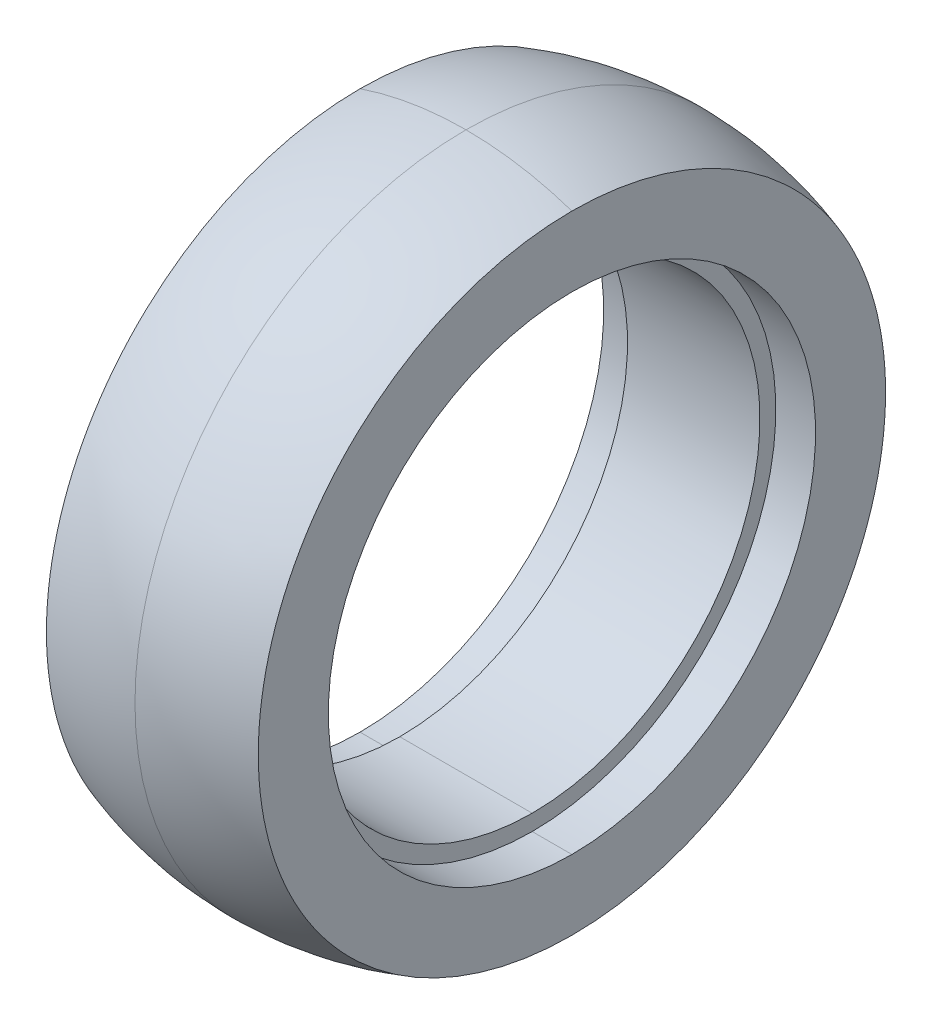
ISO-10303-21;
HEADER;
FILE_DESCRIPTION(('STEP AP214'),'2;1');
FILE_NAME('part.step','',(''),(''),'','','');
FILE_SCHEMA(('AUTOMOTIVE_DESIGN { 1 0 10303 214 1 1 1 1 }'));
ENDSEC;
DATA;
#1=APPLICATION_CONTEXT('core data for automotive mechanical design processes');
#2=APPLICATION_PROTOCOL_DEFINITION('international standard','automotive_design',2000,#1);
#3=PRODUCT_CONTEXT('',#1,'mechanical');
#4=PRODUCT('Part','Part','',(#3));
#5=PRODUCT_RELATED_PRODUCT_CATEGORY('part','',(#4));
#6=PRODUCT_DEFINITION_FORMATION('','',#4);
#7=PRODUCT_DEFINITION_CONTEXT('part definition',#1,'design');
#8=PRODUCT_DEFINITION('design','',#6,#7);
#9=PRODUCT_DEFINITION_SHAPE('','',#8);
#10=(LENGTH_UNIT() NAMED_UNIT(*) SI_UNIT(.MILLI.,.METRE.));
#11=(NAMED_UNIT(*) PLANE_ANGLE_UNIT() SI_UNIT($,.RADIAN.));
#12=(NAMED_UNIT(*) SI_UNIT($,.STERADIAN.) SOLID_ANGLE_UNIT());
#13=UNCERTAINTY_MEASURE_WITH_UNIT(LENGTH_MEASURE(1.E-05),#10,'distance_accuracy_value','');
#14=(GEOMETRIC_REPRESENTATION_CONTEXT(3) GLOBAL_UNCERTAINTY_ASSIGNED_CONTEXT((#13)) GLOBAL_UNIT_ASSIGNED_CONTEXT((#10,
#11,#12)) REPRESENTATION_CONTEXT('',''));
#15=CARTESIAN_POINT('',(0.,0.,0.));
#16=DIRECTION('',(0.,0.,1.));
#17=DIRECTION('',(1.,0.,0.));
#18=AXIS2_PLACEMENT_3D('',#15,#16,#17);
#19=CARTESIAN_POINT('',(12.5,0.,0.));
#20=DIRECTION('',(1.,0.,0.));
#21=DIRECTION('',(0.,1.,0.));
#22=AXIS2_PLACEMENT_3D('',#19,#20,#21);
#23=PLANE('',#22);
#24=CARTESIAN_POINT('',(12.5,0.,0.));
#25=DIRECTION('',(-1.,0.,0.));
#26=DIRECTION('',(0.,1.,0.));
#27=AXIS2_PLACEMENT_3D('',#24,#25,#26);
#28=CIRCLE('',#27,43.);
#29=CARTESIAN_POINT('',(12.5,43.,0.));
#30=VERTEX_POINT('',#29);
#31=CARTESIAN_POINT('',(12.5,-43.,0.));
#32=VERTEX_POINT('',#31);
#33=EDGE_CURVE('E19',#30,#32,#28,.T.);
#34=ORIENTED_EDGE('',*,*,#33,.T.);
#35=CARTESIAN_POINT('',(12.5,0.,0.));
#36=DIRECTION('',(-1.,0.,0.));
#37=DIRECTION('',(0.,-1.,0.));
#38=AXIS2_PLACEMENT_3D('',#35,#36,#37);
#39=CIRCLE('',#38,43.);
#40=EDGE_CURVE('E155',#32,#30,#39,.T.);
#41=ORIENTED_EDGE('',*,*,#40,.T.);
#42=EDGE_LOOP('',(#34,#41));
#43=FACE_BOUND('',#42,.T.);
#44=CARTESIAN_POINT('',(12.5,0.,0.));
#45=DIRECTION('',(1.,0.,0.));
#46=DIRECTION('',(0.,-1.,0.));
#47=AXIS2_PLACEMENT_3D('',#44,#45,#46);
#48=CIRCLE('',#47,46.);
#49=CARTESIAN_POINT('',(12.5,-46.,0.));
#50=VERTEX_POINT('',#49);
#51=CARTESIAN_POINT('',(12.5,46.,0.));
#52=VERTEX_POINT('',#51);
#53=EDGE_CURVE('E153',#50,#52,#48,.T.);
#54=ORIENTED_EDGE('',*,*,#53,.T.);
#55=CARTESIAN_POINT('',(12.5,0.,0.));
#56=DIRECTION('',(1.,0.,0.));
#57=DIRECTION('',(0.,1.,0.));
#58=AXIS2_PLACEMENT_3D('',#55,#56,#57);
#59=CIRCLE('',#58,46.);
#60=EDGE_CURVE('E11',#52,#50,#59,.T.);
#61=ORIENTED_EDGE('',*,*,#60,.T.);
#62=EDGE_LOOP('',(#54,#61));
#63=FACE_BOUND('',#62,.T.);
#64=ADVANCED_FACE('F16',(#43,#63),#23,.T.);
#65=CARTESIAN_POINT('',(-22.,0.,0.));
#66=DIRECTION('',(1.,0.,0.));
#67=DIRECTION('',(0.,-1.,0.));
#68=AXIS2_PLACEMENT_3D('',#65,#66,#67);
#69=CYLINDRICAL_SURFACE('',#68,46.);
#70=CARTESIAN_POINT('',(20.,0.,0.));
#71=DIRECTION('',(-1.,0.,0.));
#72=DIRECTION('',(0.,-1.,0.));
#73=AXIS2_PLACEMENT_3D('',#70,#71,#72);
#74=CIRCLE('',#73,46.);
#75=CARTESIAN_POINT('',(20.,-46.,0.));
#76=VERTEX_POINT('',#75);
#77=CARTESIAN_POINT('',(20.,46.,0.));
#78=VERTEX_POINT('',#77);
#79=EDGE_CURVE('E143',#76,#78,#74,.T.);
#80=ORIENTED_EDGE('',*,*,#79,.F.);
#81=DIRECTION('',(1.,0.,0.));
#82=VECTOR('',#81,1.);
#83=CARTESIAN_POINT('',(12.5,-46.,0.));
#84=LINE('',#83,#82);
#85=EDGE_CURVE('E146',#50,#76,#84,.T.);
#86=ORIENTED_EDGE('',*,*,#85,.F.);
#87=ORIENTED_EDGE('',*,*,#60,.F.);
#88=DIRECTION('',(1.,0.,0.));
#89=VECTOR('',#88,1.);
#90=CARTESIAN_POINT('',(12.5,46.,0.));
#91=LINE('',#90,#89);
#92=EDGE_CURVE('E24',#52,#78,#91,.T.);
#93=ORIENTED_EDGE('',*,*,#92,.T.);
#94=EDGE_LOOP('',(#80,#86,#87,#93));
#95=FACE_BOUND('',#94,.T.);
#96=ADVANCED_FACE('F191',(#95),#69,.F.);
#97=CARTESIAN_POINT('',(-22.,0.,0.));
#98=DIRECTION('',(1.,0.,0.));
#99=DIRECTION('',(0.,-1.,0.));
#100=AXIS2_PLACEMENT_3D('',#97,#98,#99);
#101=CYLINDRICAL_SURFACE('',#100,46.);
#102=CARTESIAN_POINT('',(20.,0.,0.));
#103=DIRECTION('',(-1.,0.,0.));
#104=DIRECTION('',(0.,1.,0.));
#105=AXIS2_PLACEMENT_3D('',#102,#103,#104);
#106=CIRCLE('',#105,46.);
#107=EDGE_CURVE('E140',#78,#76,#106,.T.);
#108=ORIENTED_EDGE('',*,*,#107,.F.);
#109=ORIENTED_EDGE('',*,*,#92,.F.);
#110=ORIENTED_EDGE('',*,*,#53,.F.);
#111=ORIENTED_EDGE('',*,*,#85,.T.);
#112=EDGE_LOOP('',(#108,#109,#110,#111));
#113=FACE_BOUND('',#112,.T.);
#114=ADVANCED_FACE('F195',(#113),#101,.F.);
#115=CARTESIAN_POINT('',(0.,0.,0.));
#116=DIRECTION('',(0.,0.,-1.));
#117=DIRECTION('',(0.,-1.,0.));
#118=AXIS2_PLACEMENT_3D('',#115,#116,#117);
#119=SPHERICAL_SURFACE('',#118,62.5);
#120=CARTESIAN_POINT('',(20.,0.,0.));
#121=DIRECTION('',(-1.,0.,0.));
#122=DIRECTION('',(0.,1.,0.));
#123=AXIS2_PLACEMENT_3D('',#120,#121,#122);
#124=CIRCLE('',#123,59.2135964116351);
#125=CARTESIAN_POINT('',(20.,59.2135964116351,0.));
#126=VERTEX_POINT('',#125);
#127=CARTESIAN_POINT('',(20.,-59.2135964116351,0.));
#128=VERTEX_POINT('',#127);
#129=EDGE_CURVE('E139',#126,#128,#124,.T.);
#130=ORIENTED_EDGE('',*,*,#129,.T.);
#131=CARTESIAN_POINT('',(0.,0.,0.));
#132=DIRECTION('',(0.,0.,-1.));
#133=DIRECTION('',(0.32,-0.947417542586161,0.));
#134=AXIS2_PLACEMENT_3D('',#131,#132,#133);
#135=CIRCLE('',#134,62.5);
#136=CARTESIAN_POINT('',(0.,-62.5,0.));
#137=VERTEX_POINT('',#136);
#138=EDGE_CURVE('E132',#128,#137,#135,.T.);
#139=ORIENTED_EDGE('',*,*,#138,.T.);
#140=CARTESIAN_POINT('',(0.,0.,0.));
#141=DIRECTION('',(1.,0.,0.));
#142=DIRECTION('',(0.,-1.,0.));
#143=AXIS2_PLACEMENT_3D('',#140,#141,#142);
#144=CIRCLE('',#143,62.5);
#145=CARTESIAN_POINT('',(0.,0.,-62.5));
#146=VERTEX_POINT('',#145);
#147=EDGE_CURVE('E32',#137,#146,#144,.T.);
#148=ORIENTED_EDGE('',*,*,#147,.T.);
#149=CARTESIAN_POINT('',(0.,0.,0.));
#150=DIRECTION('',(-1.,0.,0.));
#151=DIRECTION('',(0.,1.,0.));
#152=AXIS2_PLACEMENT_3D('',#149,#150,#151);
#153=CIRCLE('',#152,62.5);
#154=CARTESIAN_POINT('',(0.,62.5,0.));
#155=VERTEX_POINT('',#154);
#156=EDGE_CURVE('E127',#155,#146,#153,.T.);
#157=ORIENTED_EDGE('',*,*,#156,.F.);
#158=CARTESIAN_POINT('',(0.,0.,0.));
#159=DIRECTION('',(0.,0.,1.));
#160=DIRECTION('',(0.32,0.947417542586161,0.));
#161=AXIS2_PLACEMENT_3D('',#158,#159,#160);
#162=CIRCLE('',#161,62.5);
#163=EDGE_CURVE('E38',#126,#155,#162,.T.);
#164=ORIENTED_EDGE('',*,*,#163,.F.);
#165=EDGE_LOOP('',(#130,#139,#148,#157,#164));
#166=FACE_BOUND('',#165,.T.);
#167=ADVANCED_FACE('F200',(#166),#119,.T.);
#168=CARTESIAN_POINT('',(20.,0.,0.));
#169=DIRECTION('',(1.,0.,0.));
#170=DIRECTION('',(0.,-1.,0.));
#171=AXIS2_PLACEMENT_3D('',#168,#169,#170);
#172=PLANE('',#171);
#173=ORIENTED_EDGE('',*,*,#79,.T.);
#174=ORIENTED_EDGE('',*,*,#107,.T.);
#175=EDGE_LOOP('',(#173,#174));
#176=FACE_BOUND('',#175,.T.);
#177=ORIENTED_EDGE('',*,*,#129,.F.);
#178=CARTESIAN_POINT('',(20.,0.,0.));
#179=DIRECTION('',(-1.,0.,0.));
#180=DIRECTION('',(0.,-1.,0.));
#181=AXIS2_PLACEMENT_3D('',#178,#179,#180);
#182=CIRCLE('',#181,59.2135964116351);
#183=EDGE_CURVE('E129',#128,#126,#182,.T.);
#184=ORIENTED_EDGE('',*,*,#183,.F.);
#185=EDGE_LOOP('',(#177,#184));
#186=FACE_BOUND('',#185,.T.);
#187=ADVANCED_FACE('F206',(#176,#186),#172,.T.);
#188=CARTESIAN_POINT('',(0.,0.,0.));
#189=DIRECTION('',(0.,0.,-1.));
#190=DIRECTION('',(0.,-1.,0.));
#191=AXIS2_PLACEMENT_3D('',#188,#189,#190);
#192=SPHERICAL_SURFACE('',#191,62.5);
#193=ORIENTED_EDGE('',*,*,#163,.T.);
#194=CARTESIAN_POINT('',(0.,0.,0.));
#195=DIRECTION('',(-1.,0.,0.));
#196=DIRECTION('',(0.,0.,1.));
#197=AXIS2_PLACEMENT_3D('',#194,#195,#196);
#198=CIRCLE('',#197,62.5);
#199=CARTESIAN_POINT('',(0.,0.,62.5));
#200=VERTEX_POINT('',#199);
#201=EDGE_CURVE('E126',#200,#155,#198,.T.);
#202=ORIENTED_EDGE('',*,*,#201,.F.);
#203=CARTESIAN_POINT('',(0.,0.,0.));
#204=DIRECTION('',(1.,0.,0.));
#205=DIRECTION('',(0.,0.,1.));
#206=AXIS2_PLACEMENT_3D('',#203,#204,#205);
#207=CIRCLE('',#206,62.5);
#208=EDGE_CURVE('E133',#200,#137,#207,.T.);
#209=ORIENTED_EDGE('',*,*,#208,.T.);
#210=ORIENTED_EDGE('',*,*,#138,.F.);
#211=ORIENTED_EDGE('',*,*,#183,.T.);
#212=EDGE_LOOP('',(#193,#202,#209,#210,#211));
#213=FACE_BOUND('',#212,.T.);
#214=ADVANCED_FACE('F209',(#213),#192,.T.);
#215=CARTESIAN_POINT('',(0.,0.,0.));
#216=DIRECTION('',(0.,0.,-1.));
#217=DIRECTION('',(0.,-1.,0.));
#218=AXIS2_PLACEMENT_3D('',#215,#216,#217);
#219=SPHERICAL_SURFACE('',#218,62.5);
#220=CARTESIAN_POINT('',(-20.,0.,0.));
#221=DIRECTION('',(1.,0.,0.));
#222=DIRECTION('',(0.,1.,0.));
#223=AXIS2_PLACEMENT_3D('',#220,#221,#222);
#224=CIRCLE('',#223,59.2135964116351);
#225=CARTESIAN_POINT('',(-20.,59.2135964116351,0.));
#226=VERTEX_POINT('',#225);
#227=CARTESIAN_POINT('',(-20.,-59.2135964116351,0.));
#228=VERTEX_POINT('',#227);
#229=EDGE_CURVE('E120',#226,#228,#224,.T.);
#230=ORIENTED_EDGE('',*,*,#229,.T.);
#231=CARTESIAN_POINT('',(0.,0.,0.));
#232=DIRECTION('',(0.,0.,-1.));
#233=DIRECTION('',(0.,-1.,0.));
#234=AXIS2_PLACEMENT_3D('',#231,#232,#233);
#235=CIRCLE('',#234,62.5);
#236=EDGE_CURVE('E121',#137,#228,#235,.T.);
#237=ORIENTED_EDGE('',*,*,#236,.F.);
#238=ORIENTED_EDGE('',*,*,#208,.F.);
#239=ORIENTED_EDGE('',*,*,#201,.T.);
#240=CARTESIAN_POINT('',(0.,0.,0.));
#241=DIRECTION('',(0.,0.,1.));
#242=DIRECTION('',(0.,1.,0.));
#243=AXIS2_PLACEMENT_3D('',#240,#241,#242);
#244=CIRCLE('',#243,62.5);
#245=EDGE_CURVE('E124',#155,#226,#244,.T.);
#246=ORIENTED_EDGE('',*,*,#245,.T.);
#247=EDGE_LOOP('',(#230,#237,#238,#239,#246));
#248=FACE_BOUND('',#247,.T.);
#249=ADVANCED_FACE('F213',(#248),#219,.T.);
#250=CARTESIAN_POINT('',(0.,0.,0.));
#251=DIRECTION('',(0.,0.,-1.));
#252=DIRECTION('',(0.,-1.,0.));
#253=AXIS2_PLACEMENT_3D('',#250,#251,#252);
#254=SPHERICAL_SURFACE('',#253,62.5);
#255=ORIENTED_EDGE('',*,*,#245,.F.);
#256=ORIENTED_EDGE('',*,*,#156,.T.);
#257=ORIENTED_EDGE('',*,*,#147,.F.);
#258=ORIENTED_EDGE('',*,*,#236,.T.);
#259=CARTESIAN_POINT('',(-20.,0.,0.));
#260=DIRECTION('',(1.,0.,0.));
#261=DIRECTION('',(0.,-1.,0.));
#262=AXIS2_PLACEMENT_3D('',#259,#260,#261);
#263=CIRCLE('',#262,59.2135964116351);
#264=EDGE_CURVE('E106',#228,#226,#263,.T.);
#265=ORIENTED_EDGE('',*,*,#264,.T.);
#266=EDGE_LOOP('',(#255,#256,#257,#258,#265));
#267=FACE_BOUND('',#266,.T.);
#268=ADVANCED_FACE('F217',(#267),#254,.T.);
#269=CARTESIAN_POINT('',(-20.,0.,0.));
#270=DIRECTION('',(1.,0.,0.));
#271=DIRECTION('',(0.,-1.,0.));
#272=AXIS2_PLACEMENT_3D('',#269,#270,#271);
#273=PLANE('',#272);
#274=CARTESIAN_POINT('',(-20.,0.,0.));
#275=DIRECTION('',(1.,0.,0.));
#276=DIRECTION('',(0.,-1.,0.));
#277=AXIS2_PLACEMENT_3D('',#274,#275,#276);
#278=CIRCLE('',#277,46.);
#279=CARTESIAN_POINT('',(-20.,-46.,0.));
#280=VERTEX_POINT('',#279);
#281=CARTESIAN_POINT('',(-20.,46.,0.));
#282=VERTEX_POINT('',#281);
#283=EDGE_CURVE('E95',#280,#282,#278,.T.);
#284=ORIENTED_EDGE('',*,*,#283,.T.);
#285=CARTESIAN_POINT('',(-20.,0.,0.));
#286=DIRECTION('',(1.,0.,0.));
#287=DIRECTION('',(0.,1.,0.));
#288=AXIS2_PLACEMENT_3D('',#285,#286,#287);
#289=CIRCLE('',#288,46.);
#290=EDGE_CURVE('E91',#282,#280,#289,.T.);
#291=ORIENTED_EDGE('',*,*,#290,.T.);
#292=EDGE_LOOP('',(#284,#291));
#293=FACE_BOUND('',#292,.T.);
#294=ORIENTED_EDGE('',*,*,#229,.F.);
#295=ORIENTED_EDGE('',*,*,#264,.F.);
#296=EDGE_LOOP('',(#294,#295));
#297=FACE_BOUND('',#296,.T.);
#298=ADVANCED_FACE('F93',(#293,#297),#273,.F.);
#299=CARTESIAN_POINT('',(-22.,0.,0.));
#300=DIRECTION('',(1.,0.,0.));
#301=DIRECTION('',(0.,-1.,0.));
#302=AXIS2_PLACEMENT_3D('',#299,#300,#301);
#303=CYLINDRICAL_SURFACE('',#302,46.);
#304=ORIENTED_EDGE('',*,*,#283,.F.);
#305=DIRECTION('',(1.,0.,0.));
#306=VECTOR('',#305,1.);
#307=CARTESIAN_POINT('',(-20.,-46.,0.));
#308=LINE('',#307,#306);
#309=CARTESIAN_POINT('',(-12.5,-46.,0.));
#310=VERTEX_POINT('',#309);
#311=EDGE_CURVE('E104',#280,#310,#308,.T.);
#312=ORIENTED_EDGE('',*,*,#311,.T.);
#313=CARTESIAN_POINT('',(-12.5,0.,0.));
#314=DIRECTION('',(-1.,0.,0.));
#315=DIRECTION('',(0.,1.,0.));
#316=AXIS2_PLACEMENT_3D('',#313,#314,#315);
#317=CIRCLE('',#316,46.);
#318=CARTESIAN_POINT('',(-12.5,46.,0.));
#319=VERTEX_POINT('',#318);
#320=EDGE_CURVE('E112',#319,#310,#317,.T.);
#321=ORIENTED_EDGE('',*,*,#320,.F.);
#322=DIRECTION('',(1.,0.,0.));
#323=VECTOR('',#322,1.);
#324=CARTESIAN_POINT('',(-20.,46.,0.));
#325=LINE('',#324,#323);
#326=EDGE_CURVE('E100',#282,#319,#325,.T.);
#327=ORIENTED_EDGE('',*,*,#326,.F.);
#328=EDGE_LOOP('',(#304,#312,#321,#327));
#329=FACE_BOUND('',#328,.T.);
#330=ADVANCED_FACE('F103',(#329),#303,.F.);
#331=CARTESIAN_POINT('',(-22.,0.,0.));
#332=DIRECTION('',(1.,0.,0.));
#333=DIRECTION('',(0.,-1.,0.));
#334=AXIS2_PLACEMENT_3D('',#331,#332,#333);
#335=CYLINDRICAL_SURFACE('',#334,46.);
#336=ORIENTED_EDGE('',*,*,#290,.F.);
#337=ORIENTED_EDGE('',*,*,#326,.T.);
#338=CARTESIAN_POINT('',(-12.5,0.,0.));
#339=DIRECTION('',(-1.,0.,0.));
#340=DIRECTION('',(0.,-1.,0.));
#341=AXIS2_PLACEMENT_3D('',#338,#339,#340);
#342=CIRCLE('',#341,46.);
#343=EDGE_CURVE('E110',#310,#319,#342,.T.);
#344=ORIENTED_EDGE('',*,*,#343,.F.);
#345=ORIENTED_EDGE('',*,*,#311,.F.);
#346=EDGE_LOOP('',(#336,#337,#344,#345));
#347=FACE_BOUND('',#346,.T.);
#348=ADVANCED_FACE('F108',(#347),#335,.F.);
#349=CARTESIAN_POINT('',(-12.5,0.,0.));
#350=DIRECTION('',(1.,0.,0.));
#351=DIRECTION('',(0.,1.,0.));
#352=AXIS2_PLACEMENT_3D('',#349,#350,#351);
#353=PLANE('',#352);
#354=CARTESIAN_POINT('',(-12.5,0.,0.));
#355=DIRECTION('',(1.,0.,0.));
#356=DIRECTION('',(0.,-1.,0.));
#357=AXIS2_PLACEMENT_3D('',#354,#355,#356);
#358=CIRCLE('',#357,43.);
#359=CARTESIAN_POINT('',(-12.5,-43.,0.));
#360=VERTEX_POINT('',#359);
#361=CARTESIAN_POINT('',(-12.5,43.,0.));
#362=VERTEX_POINT('',#361);
#363=EDGE_CURVE('E156',#360,#362,#358,.T.);
#364=ORIENTED_EDGE('',*,*,#363,.T.);
#365=CARTESIAN_POINT('',(-12.5,0.,0.));
#366=DIRECTION('',(1.,0.,0.));
#367=DIRECTION('',(0.,1.,0.));
#368=AXIS2_PLACEMENT_3D('',#365,#366,#367);
#369=CIRCLE('',#368,43.);
#370=EDGE_CURVE('E162',#362,#360,#369,.T.);
#371=ORIENTED_EDGE('',*,*,#370,.T.);
#372=EDGE_LOOP('',(#364,#371));
#373=FACE_BOUND('',#372,.T.);
#374=ORIENTED_EDGE('',*,*,#320,.T.);
#375=ORIENTED_EDGE('',*,*,#343,.T.);
#376=EDGE_LOOP('',(#374,#375));
#377=FACE_BOUND('',#376,.T.);
#378=ADVANCED_FACE('F180',(#373,#377),#353,.F.);
#379=CARTESIAN_POINT('',(-12.5,0.,0.));
#380=DIRECTION('',(1.,0.,0.));
#381=DIRECTION('',(0.,1.,0.));
#382=AXIS2_PLACEMENT_3D('',#379,#380,#381);
#383=CYLINDRICAL_SURFACE('',#382,43.);
#384=ORIENTED_EDGE('',*,*,#33,.F.);
#385=DIRECTION('',(-1.,0.,0.));
#386=VECTOR('',#385,1.);
#387=CARTESIAN_POINT('',(12.5,43.,0.));
#388=LINE('',#387,#386);
#389=EDGE_CURVE('E167',#30,#362,#388,.T.);
#390=ORIENTED_EDGE('',*,*,#389,.T.);
#391=ORIENTED_EDGE('',*,*,#363,.F.);
#392=DIRECTION('',(-1.,0.,0.));
#393=VECTOR('',#392,1.);
#394=CARTESIAN_POINT('',(12.5,-43.,0.));
#395=LINE('',#394,#393);
#396=EDGE_CURVE('E157',#32,#360,#395,.T.);
#397=ORIENTED_EDGE('',*,*,#396,.F.);
#398=EDGE_LOOP('',(#384,#390,#391,#397));
#399=FACE_BOUND('',#398,.T.);
#400=ADVANCED_FACE('F177',(#399),#383,.F.);
#401=CARTESIAN_POINT('',(-12.5,0.,0.));
#402=DIRECTION('',(1.,0.,0.));
#403=DIRECTION('',(0.,1.,0.));
#404=AXIS2_PLACEMENT_3D('',#401,#402,#403);
#405=CYLINDRICAL_SURFACE('',#404,43.);
#406=ORIENTED_EDGE('',*,*,#40,.F.);
#407=ORIENTED_EDGE('',*,*,#396,.T.);
#408=ORIENTED_EDGE('',*,*,#370,.F.);
#409=ORIENTED_EDGE('',*,*,#389,.F.);
#410=EDGE_LOOP('',(#406,#407,#408,#409));
#411=FACE_BOUND('',#410,.T.);
#412=ADVANCED_FACE('F178',(#411),#405,.F.);
#413=CLOSED_SHELL('',(#64,#96,#114,#167,#187,#214,#249,#268,#298,#330,#348,#378,#400,#412));
#414=MANIFOLD_SOLID_BREP('B1',#413);
#415=ADVANCED_BREP_SHAPE_REPRESENTATION('',(#18,#414),#14);
#416=SHAPE_DEFINITION_REPRESENTATION(#9,#415);
ENDSEC;
END-ISO-10303-21;
